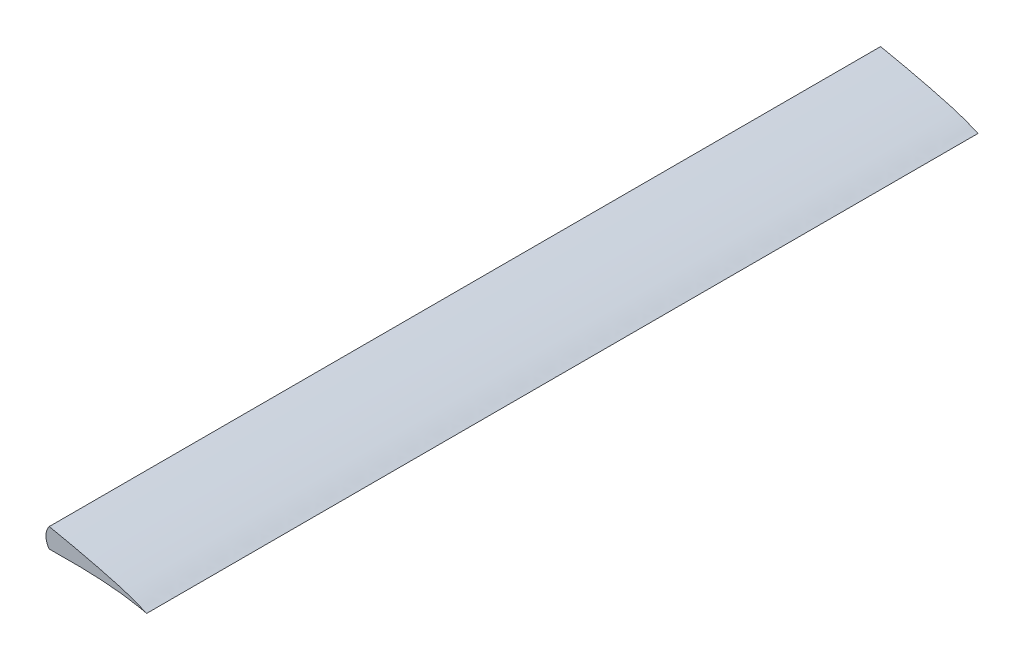
ISO-10303-21;
HEADER;
FILE_DESCRIPTION(('STEP AP214'),'2;1');
FILE_NAME('part.step','',(''),(''),'','','');
FILE_SCHEMA(('AUTOMOTIVE_DESIGN { 1 0 10303 214 1 1 1 1 }'));
ENDSEC;
DATA;
#1=APPLICATION_CONTEXT('core data for automotive mechanical design processes');
#2=APPLICATION_PROTOCOL_DEFINITION('international standard','automotive_design',2000,#1);
#3=PRODUCT_CONTEXT('',#1,'mechanical');
#4=PRODUCT('Part','Part','',(#3));
#5=PRODUCT_RELATED_PRODUCT_CATEGORY('part','',(#4));
#6=PRODUCT_DEFINITION_FORMATION('','',#4);
#7=PRODUCT_DEFINITION_CONTEXT('part definition',#1,'design');
#8=PRODUCT_DEFINITION('design','',#6,#7);
#9=PRODUCT_DEFINITION_SHAPE('','',#8);
#10=(LENGTH_UNIT() NAMED_UNIT(*) SI_UNIT(.MILLI.,.METRE.));
#11=(NAMED_UNIT(*) PLANE_ANGLE_UNIT() SI_UNIT($,.RADIAN.));
#12=(NAMED_UNIT(*) SI_UNIT($,.STERADIAN.) SOLID_ANGLE_UNIT());
#13=UNCERTAINTY_MEASURE_WITH_UNIT(LENGTH_MEASURE(1.E-05),#10,'distance_accuracy_value','');
#14=(GEOMETRIC_REPRESENTATION_CONTEXT(3) GLOBAL_UNCERTAINTY_ASSIGNED_CONTEXT((#13)) GLOBAL_UNIT_ASSIGNED_CONTEXT((#10,
#11,#12)) REPRESENTATION_CONTEXT('',''));
#15=CARTESIAN_POINT('',(0.,0.,0.));
#16=DIRECTION('',(0.,0.,1.));
#17=DIRECTION('',(1.,0.,0.));
#18=AXIS2_PLACEMENT_3D('',#15,#16,#17);
#19=CARTESIAN_POINT('',(175.4,-51.0817291700816,400.));
#20=DIRECTION('',(0.,0.,-1.));
#21=DIRECTION('',(-1.,0.,0.));
#22=AXIS2_PLACEMENT_3D('',#19,#20,#21);
#23=PLANE('',#22);
#24=CARTESIAN_POINT('',(183.413882059346,7.26826098281841,400.));
#25=DIRECTION('',(0.,0.,-1.));
#26=DIRECTION('',(-1.,0.,0.));
#27=AXIS2_PLACEMENT_3D('',#24,#25,#26);
#28=CIRCLE('',#27,7.01388205934639);
#29=CARTESIAN_POINT('',(177.812529572732,11.4895631353684,400.));
#30=VERTEX_POINT('',#29);
#31=CARTESIAN_POINT('',(177.812529572732,3.04695883026841,400.));
#32=VERTEX_POINT('',#31);
#33=EDGE_CURVE('E11',#30,#32,#28,.F.);
#34=ORIENTED_EDGE('',*,*,#33,.T.);
#35=CARTESIAN_POINT('',(220.,0.,400.));
#36=CARTESIAN_POINT('',(219.998135293767,0.0191225425309972,400.));
#37=CARTESIAN_POINT('',(218.563905966725,0.543039625657677,400.));
#38=CARTESIAN_POINT('',(217.20283397394,1.19506017421227,400.));
#39=CARTESIAN_POINT('',(214.031853569222,2.45678552628715,400.));
#40=CARTESIAN_POINT('',(210.151366241462,3.72531727304098,400.));
#41=CARTESIAN_POINT('',(205.114815696557,5.15928248664105,400.));
#42=CARTESIAN_POINT('',(199.14964780809,6.71134018240223,400.));
#43=CARTESIAN_POINT('',(192.261467460595,8.36943260107725,400.));
#44=CARTESIAN_POINT('',(184.566730431051,10.0937282659789,400.));
#45=CARTESIAN_POINT('',(176.157122434261,11.8465154330067,400.));
#46=CARTESIAN_POINT('',(167.143563762653,13.587188485223,400.));
#47=CARTESIAN_POINT('',(157.630842571206,15.259025942974,400.));
#48=CARTESIAN_POINT('',(147.72348450102,16.8089960125058,400.));
#49=CARTESIAN_POINT('',(137.513834505798,18.1768764664825,400.));
#50=CARTESIAN_POINT('',(127.090281764989,19.3141899261374,400.));
#51=CARTESIAN_POINT('',(116.546539847381,20.2076033146111,400.));
#52=CARTESIAN_POINT('',(105.975444526573,20.8389760417604,400.));
#53=CARTESIAN_POINT('',(95.473894774915,21.1808923564011,400.));
#54=CARTESIAN_POINT('',(85.134077393814,21.2272130603593,400.));
#55=CARTESIAN_POINT('',(75.0472664405052,20.9787773994836,400.));
#56=CARTESIAN_POINT('',(65.2981115924985,20.4252354628598,400.));
#57=CARTESIAN_POINT('',(55.9689699217446,19.5806173800514,400.));
#58=CARTESIAN_POINT('',(47.1371124293744,18.4654986615953,400.));
#59=CARTESIAN_POINT('',(38.8777560084112,17.1147129679049,400.));
#60=CARTESIAN_POINT('',(31.2664863344402,15.5456889196238,400.));
#61=CARTESIAN_POINT('',(24.3693507678324,13.8086937415809,400.));
#62=CARTESIAN_POINT('',(18.2506084700204,11.9251431470754,400.));
#63=CARTESIAN_POINT('',(12.9616609923885,9.94616952617603,400.));
#64=CARTESIAN_POINT('',(8.54252436699059,7.91245040450087,400.));
#65=CARTESIAN_POINT('',(5.03293848964225,5.87585399716885,400.));
#66=CARTESIAN_POINT('',(2.41268879612609,3.85529590908558,400.));
#67=CARTESIAN_POINT('',(0.795727091619395,1.96887121098757,400.));
#68=CARTESIAN_POINT('',(0.0193203510412573,0.636294862544327,400.));
#69=CARTESIAN_POINT('',(-0.0131603655030873,-0.390728837201042,400.));
#70=CARTESIAN_POINT('',(0.652147561937354,-1.5040263349332,400.));
#71=CARTESIAN_POINT('',(2.84555476447763,-2.15047502470151,400.));
#72=CARTESIAN_POINT('',(5.95478019924009,-2.99217874111945,400.));
#73=CARTESIAN_POINT('',(10.3129394929953,-3.59208332694786,400.));
#74=CARTESIAN_POINT('',(15.7418999573217,-4.10829283631496,400.));
#75=CARTESIAN_POINT('',(22.2368972731783,-4.46405657887578,400.));
#76=CARTESIAN_POINT('',(29.7101112350732,-4.682869661066,400.));
#77=CARTESIAN_POINT('',(38.0858156323068,-4.76513095374196,400.));
#78=CARTESIAN_POINT('',(47.2679750207055,-4.70788619000047,400.));
#79=CARTESIAN_POINT('',(57.1540265679188,-4.51740619066486,400.));
#80=CARTESIAN_POINT('',(67.6356229659081,-4.19434473302094,400.));
#81=CARTESIAN_POINT('',(78.5995140012949,-3.72550491219786,400.));
#82=CARTESIAN_POINT('',(89.9344874853078,-3.12302905761447,400.));
#83=CARTESIAN_POINT('',(101.539597944926,-2.36156134099406,400.));
#84=CARTESIAN_POINT('',(113.340366387123,-1.4186747641075,400.));
#85=CARTESIAN_POINT('',(125.265410370338,-0.330029884994195,400.));
#86=CARTESIAN_POINT('',(137.22273051773,0.724039666882658,400.));
#87=CARTESIAN_POINT('',(149.057203713643,1.66081403701241,400.));
#88=CARTESIAN_POINT('',(160.582132875366,2.40905333911014,400.));
#89=CARTESIAN_POINT('',(171.603467213129,2.91449381693141,400.));
#90=CARTESIAN_POINT('',(181.920918082224,3.15551528287481,400.));
#91=CARTESIAN_POINT('',(191.351441206849,3.11041944608691,400.));
#92=CARTESIAN_POINT('',(199.668422575016,2.81305538760343,400.));
#93=CARTESIAN_POINT('',(206.782466820321,2.25074280968079,400.));
#94=CARTESIAN_POINT('',(212.210847162939,1.58227429483308,400.));
#95=CARTESIAN_POINT('',(216.562639419723,0.757550834406664,400.));
#96=CARTESIAN_POINT('',(218.315722177023,0.434845518252458,400.));
#97=CARTESIAN_POINT('',(220.001969683317,-0.0201990814021091,400.));
#98=CARTESIAN_POINT('',(220.,0.,400.));
#99=B_SPLINE_CURVE_WITH_KNOTS('',3,(#35,#36,#37,#38,#39,#40,#41,#42,#43,#44,#45,#46,#47,#48,#49,
#50,#51,#52,#53,#54,#55,#56,#57,#58,#59,#60,#61,#62,#63,#64,#65,#66,#67,#68,#69,#70,#71,#72,#73,
#74,#75,#76,#77,#78,#79,#80,#81,#82,#83,#84,#85,#86,#87,#88,#89,#90,#91,#92,#93,#94,#95,#96,#97,
#98),.UNSPECIFIED.,.T.,.F.,(4,1,1,1,1,1,1,1,1,1,1,1,1,1,1,1,1,1,1,1,1,1,1,1,1,1,1,1,1,1,1,1,1,1,
1,1,1,1,1,1,1,1,1,1,1,1,1,1,1,1,1,1,1,1,1,1,1,1,1,1,1,4),(0.,0.00169352365364152,
0.00639544747949773,0.0134616508959297,0.0227535749736498,0.0343673071517183,0.0481910226954883,
0.064031392481717,0.0816806172414246,0.100894124121338,0.121431793819588,0.143025453493653,
0.165434010835678,0.188439038764568,0.211855124404938,0.235496289450679,0.259143745164547,
0.282614908314604,0.30570154453718,0.328231583662434,0.350030433806964,0.370943883213179,
0.390816528552158,0.409505873078083,0.426856550273814,0.442733384525219,0.457018387509694,
0.469615069942757,0.480449695456552,0.489471860268703,0.496730301180352,0.502329146614106,
0.506255660132997,0.506441944995434,0.509181515928635,0.513913846214958,0.521178418676577,
0.530944156675701,0.543144508951146,0.557669673966592,0.574383525920582,0.593109554408619,
0.613638211877394,0.635743557157375,0.659184094922804,0.683713689413154,0.709075753928382,
0.735036066440786,0.761429738598203,0.7881837663948,0.815056829999432,0.84164476376198,
0.867513560484753,0.892232408519161,0.915363656349594,0.936485324642644,0.955199831872162,
0.971104187426938,0.983751025641108,0.992812817585366,0.998211136302568,1.),.UNSPECIFIED.);
#100=EDGE_CURVE('E40',#30,#32,#99,.F.);
#101=ORIENTED_EDGE('',*,*,#100,.F.);
#102=EDGE_LOOP('',(#34,#101));
#103=FACE_BOUND('',#102,.T.);
#104=ADVANCED_FACE('F36',(#103),#23,.F.);
#105=CARTESIAN_POINT('',(175.4,46.3323962542948,39.9999999999998));
#106=DIRECTION('',(0.,0.,1.));
#107=DIRECTION('',(0.,-1.,0.));
#108=AXIS2_PLACEMENT_3D('',#105,#106,#107);
#109=PLANE('',#108);
#110=CARTESIAN_POINT('',(183.413882059346,7.26826098281841,40.));
#111=DIRECTION('',(0.,0.,-1.));
#112=DIRECTION('',(-1.,0.,0.));
#113=AXIS2_PLACEMENT_3D('',#110,#111,#112);
#114=CIRCLE('',#113,7.01388205934639);
#115=CARTESIAN_POINT('',(177.812529572732,11.4895631353684,40.));
#116=VERTEX_POINT('',#115);
#117=CARTESIAN_POINT('',(177.812529572732,3.04695883026841,40.));
#118=VERTEX_POINT('',#117);
#119=EDGE_CURVE('E66',#116,#118,#114,.F.);
#120=ORIENTED_EDGE('',*,*,#119,.F.);
#121=CARTESIAN_POINT('',(220.,0.,39.9999999999998));
#122=CARTESIAN_POINT('',(219.998135293767,0.0191225425309972,39.9999999999998));
#123=CARTESIAN_POINT('',(218.563905966725,0.543039625657677,39.9999999999998));
#124=CARTESIAN_POINT('',(217.20283397394,1.19506017421227,39.9999999999998));
#125=CARTESIAN_POINT('',(214.031853569222,2.45678552628715,39.9999999999998));
#126=CARTESIAN_POINT('',(210.151366241462,3.72531727304098,39.9999999999998));
#127=CARTESIAN_POINT('',(205.114815696557,5.15928248664105,39.9999999999998));
#128=CARTESIAN_POINT('',(199.14964780809,6.71134018240223,39.9999999999998));
#129=CARTESIAN_POINT('',(192.261467460595,8.36943260107725,39.9999999999998));
#130=CARTESIAN_POINT('',(184.566730431051,10.0937282659789,39.9999999999998));
#131=CARTESIAN_POINT('',(176.157122434261,11.8465154330067,39.9999999999998));
#132=CARTESIAN_POINT('',(167.143563762653,13.587188485223,39.9999999999998));
#133=CARTESIAN_POINT('',(157.630842571206,15.259025942974,39.9999999999998));
#134=CARTESIAN_POINT('',(147.72348450102,16.8089960125058,39.9999999999998));
#135=CARTESIAN_POINT('',(137.513834505798,18.1768764664825,39.9999999999998));
#136=CARTESIAN_POINT('',(127.090281764989,19.3141899261374,39.9999999999998));
#137=CARTESIAN_POINT('',(116.546539847381,20.2076033146111,39.9999999999998));
#138=CARTESIAN_POINT('',(105.975444526573,20.8389760417604,39.9999999999998));
#139=CARTESIAN_POINT('',(95.473894774915,21.1808923564011,39.9999999999998));
#140=CARTESIAN_POINT('',(85.134077393814,21.2272130603593,39.9999999999998));
#141=CARTESIAN_POINT('',(75.0472664405052,20.9787773994836,39.9999999999998));
#142=CARTESIAN_POINT('',(65.2981115924985,20.4252354628598,39.9999999999998));
#143=CARTESIAN_POINT('',(55.9689699217446,19.5806173800514,39.9999999999998));
#144=CARTESIAN_POINT('',(47.1371124293744,18.4654986615953,39.9999999999998));
#145=CARTESIAN_POINT('',(38.8777560084112,17.1147129679049,39.9999999999998));
#146=CARTESIAN_POINT('',(31.2664863344402,15.5456889196238,39.9999999999998));
#147=CARTESIAN_POINT('',(24.3693507678324,13.8086937415809,39.9999999999998));
#148=CARTESIAN_POINT('',(18.2506084700204,11.9251431470754,39.9999999999998));
#149=CARTESIAN_POINT('',(12.9616609923885,9.94616952617603,39.9999999999998));
#150=CARTESIAN_POINT('',(8.54252436699059,7.91245040450087,39.9999999999998));
#151=CARTESIAN_POINT('',(5.03293848964225,5.87585399716885,39.9999999999998));
#152=CARTESIAN_POINT('',(2.41268879612609,3.85529590908558,39.9999999999998));
#153=CARTESIAN_POINT('',(0.795727091619395,1.96887121098757,39.9999999999998));
#154=CARTESIAN_POINT('',(0.0193203510412573,0.636294862544327,39.9999999999998));
#155=CARTESIAN_POINT('',(-0.0131603655030873,-0.390728837201042,39.9999999999998));
#156=CARTESIAN_POINT('',(0.652147561937354,-1.5040263349332,39.9999999999998));
#157=CARTESIAN_POINT('',(2.84555476447763,-2.15047502470151,39.9999999999998));
#158=CARTESIAN_POINT('',(5.95478019924009,-2.99217874111945,39.9999999999998));
#159=CARTESIAN_POINT('',(10.3129394929953,-3.59208332694786,39.9999999999998));
#160=CARTESIAN_POINT('',(15.7418999573217,-4.10829283631496,39.9999999999998));
#161=CARTESIAN_POINT('',(22.2368972731783,-4.46405657887578,39.9999999999998));
#162=CARTESIAN_POINT('',(29.7101112350732,-4.682869661066,39.9999999999998));
#163=CARTESIAN_POINT('',(38.0858156323068,-4.76513095374196,39.9999999999998));
#164=CARTESIAN_POINT('',(47.2679750207055,-4.70788619000047,39.9999999999998));
#165=CARTESIAN_POINT('',(57.1540265679188,-4.51740619066486,39.9999999999998));
#166=CARTESIAN_POINT('',(67.6356229659081,-4.19434473302094,39.9999999999998));
#167=CARTESIAN_POINT('',(78.5995140012949,-3.72550491219786,39.9999999999998));
#168=CARTESIAN_POINT('',(89.9344874853078,-3.12302905761447,39.9999999999998));
#169=CARTESIAN_POINT('',(101.539597944926,-2.36156134099406,39.9999999999998));
#170=CARTESIAN_POINT('',(113.340366387123,-1.4186747641075,39.9999999999998));
#171=CARTESIAN_POINT('',(125.265410370338,-0.330029884994195,39.9999999999998));
#172=CARTESIAN_POINT('',(137.22273051773,0.724039666882658,39.9999999999998));
#173=CARTESIAN_POINT('',(149.057203713643,1.66081403701241,39.9999999999998));
#174=CARTESIAN_POINT('',(160.582132875366,2.40905333911014,39.9999999999998));
#175=CARTESIAN_POINT('',(171.603467213129,2.91449381693141,39.9999999999998));
#176=CARTESIAN_POINT('',(181.920918082224,3.15551528287481,39.9999999999998));
#177=CARTESIAN_POINT('',(191.351441206849,3.11041944608691,39.9999999999998));
#178=CARTESIAN_POINT('',(199.668422575016,2.81305538760343,39.9999999999998));
#179=CARTESIAN_POINT('',(206.782466820321,2.25074280968079,39.9999999999998));
#180=CARTESIAN_POINT('',(212.210847162939,1.58227429483308,39.9999999999998));
#181=CARTESIAN_POINT('',(216.562639419723,0.757550834406664,39.9999999999998));
#182=CARTESIAN_POINT('',(218.315722177023,0.434845518252458,39.9999999999998));
#183=CARTESIAN_POINT('',(220.001969683317,-0.0201990814021091,39.9999999999998));
#184=CARTESIAN_POINT('',(220.,0.,39.9999999999998));
#185=B_SPLINE_CURVE_WITH_KNOTS('',3,(#121,#122,#123,#124,#125,#126,#127,#128,#129,#130,#131,
#132,#133,#134,#135,#136,#137,#138,#139,#140,#141,#142,#143,#144,#145,#146,#147,#148,#149,#150,
#151,#152,#153,#154,#155,#156,#157,#158,#159,#160,#161,#162,#163,#164,#165,#166,#167,#168,#169,
#170,#171,#172,#173,#174,#175,#176,#177,#178,#179,#180,#181,#182,#183,#184),.UNSPECIFIED.,.T.,
.F.,(4,1,1,1,1,1,1,1,1,1,1,1,1,1,1,1,1,1,1,1,1,1,1,1,1,1,1,1,1,1,1,1,1,1,1,1,1,1,1,1,1,1,1,1,1,
1,1,1,1,1,1,1,1,1,1,1,1,1,1,1,1,4),(0.,0.00169352365364152,0.00639544747949773,
0.0134616508959297,0.0227535749736498,0.0343673071517183,0.0481910226954883,0.064031392481717,
0.0816806172414246,0.100894124121338,0.121431793819588,0.143025453493653,0.165434010835678,
0.188439038764568,0.211855124404938,0.235496289450679,0.259143745164547,0.282614908314604,
0.30570154453718,0.328231583662434,0.350030433806964,0.370943883213179,0.390816528552158,
0.409505873078083,0.426856550273814,0.442733384525219,0.457018387509694,0.469615069942757,
0.480449695456552,0.489471860268703,0.496730301180352,0.502329146614106,0.506255660132997,
0.506441944995434,0.509181515928635,0.513913846214958,0.521178418676577,0.530944156675701,
0.543144508951146,0.557669673966592,0.574383525920582,0.593109554408619,0.613638211877394,
0.635743557157375,0.659184094922804,0.683713689413154,0.709075753928382,0.735036066440786,
0.761429738598203,0.7881837663948,0.815056829999432,0.84164476376198,0.867513560484753,
0.892232408519161,0.915363656349594,0.936485324642644,0.955199831872162,0.971104187426938,
0.983751025641108,0.992812817585366,0.998211136302568,1.),.UNSPECIFIED.);
#186=EDGE_CURVE('E64',#118,#116,#185,.T.);
#187=ORIENTED_EDGE('',*,*,#186,.F.);
#188=EDGE_LOOP('',(#120,#187));
#189=FACE_BOUND('',#188,.T.);
#190=ADVANCED_FACE('F38',(#189),#109,.F.);
#191=CARTESIAN_POINT('',(220.,0.,1000.));
#192=CARTESIAN_POINT('',(219.998135293767,0.0191225425309972,1000.));
#193=CARTESIAN_POINT('',(218.563905966725,0.543039625657677,1000.));
#194=CARTESIAN_POINT('',(217.20283397394,1.19506017421227,1000.));
#195=CARTESIAN_POINT('',(214.031853569222,2.45678552628715,1000.));
#196=CARTESIAN_POINT('',(210.151366241462,3.72531727304098,1000.));
#197=CARTESIAN_POINT('',(205.114815696557,5.15928248664105,1000.));
#198=CARTESIAN_POINT('',(199.14964780809,6.71134018240223,1000.));
#199=CARTESIAN_POINT('',(192.261467460595,8.36943260107725,1000.));
#200=CARTESIAN_POINT('',(184.566730431051,10.0937282659789,1000.));
#201=CARTESIAN_POINT('',(176.157122434261,11.8465154330067,1000.));
#202=CARTESIAN_POINT('',(167.143563762653,13.587188485223,1000.));
#203=CARTESIAN_POINT('',(157.630842571206,15.259025942974,1000.));
#204=CARTESIAN_POINT('',(147.72348450102,16.8089960125058,1000.));
#205=CARTESIAN_POINT('',(137.513834505798,18.1768764664825,1000.));
#206=CARTESIAN_POINT('',(127.090281764989,19.3141899261374,1000.));
#207=CARTESIAN_POINT('',(116.546539847381,20.2076033146111,1000.));
#208=CARTESIAN_POINT('',(105.975444526573,20.8389760417604,1000.));
#209=CARTESIAN_POINT('',(95.473894774915,21.1808923564011,1000.));
#210=CARTESIAN_POINT('',(85.134077393814,21.2272130603593,1000.));
#211=CARTESIAN_POINT('',(75.0472664405052,20.9787773994836,1000.));
#212=CARTESIAN_POINT('',(65.2981115924985,20.4252354628598,1000.));
#213=CARTESIAN_POINT('',(55.9689699217446,19.5806173800514,1000.));
#214=CARTESIAN_POINT('',(47.1371124293744,18.4654986615953,1000.));
#215=CARTESIAN_POINT('',(38.8777560084112,17.1147129679049,1000.));
#216=CARTESIAN_POINT('',(31.2664863344402,15.5456889196238,1000.));
#217=CARTESIAN_POINT('',(24.3693507678324,13.8086937415809,1000.));
#218=CARTESIAN_POINT('',(18.2506084700204,11.9251431470754,1000.));
#219=CARTESIAN_POINT('',(12.9616609923885,9.94616952617603,1000.));
#220=CARTESIAN_POINT('',(8.54252436699059,7.91245040450087,1000.));
#221=CARTESIAN_POINT('',(5.03293848964225,5.87585399716885,1000.));
#222=CARTESIAN_POINT('',(2.41268879612609,3.85529590908558,1000.));
#223=CARTESIAN_POINT('',(0.795727091619395,1.96887121098757,1000.));
#224=CARTESIAN_POINT('',(0.0193203510412573,0.636294862544327,1000.));
#225=CARTESIAN_POINT('',(-0.0131603655030873,-0.390728837201042,1000.));
#226=CARTESIAN_POINT('',(0.652147561937354,-1.5040263349332,1000.));
#227=CARTESIAN_POINT('',(2.84555476447763,-2.15047502470151,1000.));
#228=CARTESIAN_POINT('',(5.95478019924009,-2.99217874111945,1000.));
#229=CARTESIAN_POINT('',(10.3129394929953,-3.59208332694786,1000.));
#230=CARTESIAN_POINT('',(15.7418999573217,-4.10829283631496,1000.));
#231=CARTESIAN_POINT('',(22.2368972731783,-4.46405657887578,1000.));
#232=CARTESIAN_POINT('',(29.7101112350732,-4.682869661066,1000.));
#233=CARTESIAN_POINT('',(38.0858156323068,-4.76513095374196,1000.));
#234=CARTESIAN_POINT('',(47.2679750207055,-4.70788619000047,1000.));
#235=CARTESIAN_POINT('',(57.1540265679188,-4.51740619066486,1000.));
#236=CARTESIAN_POINT('',(67.6356229659081,-4.19434473302094,1000.));
#237=CARTESIAN_POINT('',(78.5995140012949,-3.72550491219786,1000.));
#238=CARTESIAN_POINT('',(89.9344874853078,-3.12302905761447,1000.));
#239=CARTESIAN_POINT('',(101.539597944926,-2.36156134099406,1000.));
#240=CARTESIAN_POINT('',(113.340366387123,-1.4186747641075,1000.));
#241=CARTESIAN_POINT('',(125.265410370338,-0.330029884994195,1000.));
#242=CARTESIAN_POINT('',(137.22273051773,0.724039666882658,1000.));
#243=CARTESIAN_POINT('',(149.057203713643,1.66081403701241,1000.));
#244=CARTESIAN_POINT('',(160.582132875366,2.40905333911014,1000.));
#245=CARTESIAN_POINT('',(171.603467213129,2.91449381693141,1000.));
#246=CARTESIAN_POINT('',(181.920918082224,3.15551528287481,1000.));
#247=CARTESIAN_POINT('',(191.351441206849,3.11041944608691,1000.));
#248=CARTESIAN_POINT('',(199.668422575016,2.81305538760343,1000.));
#249=CARTESIAN_POINT('',(206.782466820321,2.25074280968079,1000.));
#250=CARTESIAN_POINT('',(212.210847162939,1.58227429483308,1000.));
#251=CARTESIAN_POINT('',(216.562639419723,0.757550834406664,1000.));
#252=CARTESIAN_POINT('',(218.315722177023,0.434845518252458,1000.));
#253=CARTESIAN_POINT('',(220.001969683317,-0.0201990814021091,1000.));
#254=CARTESIAN_POINT('',(220.,0.,1000.));
#255=B_SPLINE_CURVE_WITH_KNOTS('',3,(#191,#192,#193,#194,#195,#196,#197,#198,#199,#200,#201,
#202,#203,#204,#205,#206,#207,#208,#209,#210,#211,#212,#213,#214,#215,#216,#217,#218,#219,#220,
#221,#222,#223,#224,#225,#226,#227,#228,#229,#230,#231,#232,#233,#234,#235,#236,#237,#238,#239,
#240,#241,#242,#243,#244,#245,#246,#247,#248,#249,#250,#251,#252,#253,#254),.UNSPECIFIED.,.T.,
.F.,(4,1,1,1,1,1,1,1,1,1,1,1,1,1,1,1,1,1,1,1,1,1,1,1,1,1,1,1,1,1,1,1,1,1,1,1,1,1,1,1,1,1,1,1,1,
1,1,1,1,1,1,1,1,1,1,1,1,1,1,1,1,4),(0.,0.00169352365364152,0.00639544747949773,
0.0134616508959297,0.0227535749736498,0.0343673071517183,0.0481910226954883,0.064031392481717,
0.0816806172414246,0.100894124121338,0.121431793819588,0.143025453493653,0.165434010835678,
0.188439038764568,0.211855124404938,0.235496289450679,0.259143745164547,0.282614908314604,
0.30570154453718,0.328231583662434,0.350030433806964,0.370943883213179,0.390816528552158,
0.409505873078083,0.426856550273814,0.442733384525219,0.457018387509694,0.469615069942757,
0.480449695456552,0.489471860268703,0.496730301180352,0.502329146614106,0.506255660132997,
0.506441944995434,0.509181515928635,0.513913846214958,0.521178418676577,0.530944156675701,
0.543144508951146,0.557669673966592,0.574383525920582,0.593109554408619,0.613638211877394,
0.635743557157375,0.659184094922804,0.683713689413154,0.709075753928382,0.735036066440786,
0.761429738598203,0.7881837663948,0.815056829999432,0.84164476376198,0.867513560484753,
0.892232408519161,0.915363656349594,0.936485324642644,0.955199831872162,0.971104187426938,
0.983751025641108,0.992812817585366,0.998211136302568,1.),.UNSPECIFIED.);
#256=DIRECTION('',(0.,0.,-1.));
#257=VECTOR('',#256,1.);
#258=SURFACE_OF_LINEAR_EXTRUSION('',#255,#257);
#259=DIRECTION('',(0.,0.,-1.));
#260=VECTOR('',#259,1.);
#261=CARTESIAN_POINT('',(177.812529572732,11.4895631353684,400.));
#262=LINE('',#261,#260);
#263=EDGE_CURVE('E72',#30,#116,#262,.T.);
#264=ORIENTED_EDGE('',*,*,#263,.F.);
#265=ORIENTED_EDGE('',*,*,#100,.T.);
#266=DIRECTION('',(0.,0.,-1.));
#267=VECTOR('',#266,1.);
#268=CARTESIAN_POINT('',(177.812529572732,3.04695883026841,400.));
#269=LINE('',#268,#267);
#270=EDGE_CURVE('E68',#32,#118,#269,.T.);
#271=ORIENTED_EDGE('',*,*,#270,.T.);
#272=ORIENTED_EDGE('',*,*,#186,.T.);
#273=EDGE_LOOP('',(#264,#265,#271,#272));
#274=FACE_BOUND('',#273,.T.);
#275=ADVANCED_FACE('F74',(#274),#258,.F.);
#276=CARTESIAN_POINT('',(183.413882059346,7.26826098281841,400.));
#277=DIRECTION('',(0.,0.,-1.));
#278=DIRECTION('',(-1.,0.,0.));
#279=AXIS2_PLACEMENT_3D('',#276,#277,#278);
#280=CYLINDRICAL_SURFACE('',#279,7.01388205934639);
#281=ORIENTED_EDGE('',*,*,#119,.T.);
#282=ORIENTED_EDGE('',*,*,#270,.F.);
#283=ORIENTED_EDGE('',*,*,#33,.F.);
#284=ORIENTED_EDGE('',*,*,#263,.T.);
#285=EDGE_LOOP('',(#281,#282,#283,#284));
#286=FACE_BOUND('',#285,.T.);
#287=ADVANCED_FACE('F71',(#286),#280,.T.);
#288=CLOSED_SHELL('',(#104,#190,#275,#287));
#289=MANIFOLD_SOLID_BREP('B2',#288);
#290=ADVANCED_BREP_SHAPE_REPRESENTATION('',(#18,#289),#14);
#291=SHAPE_DEFINITION_REPRESENTATION(#9,#290);
ENDSEC;
END-ISO-10303-21;
